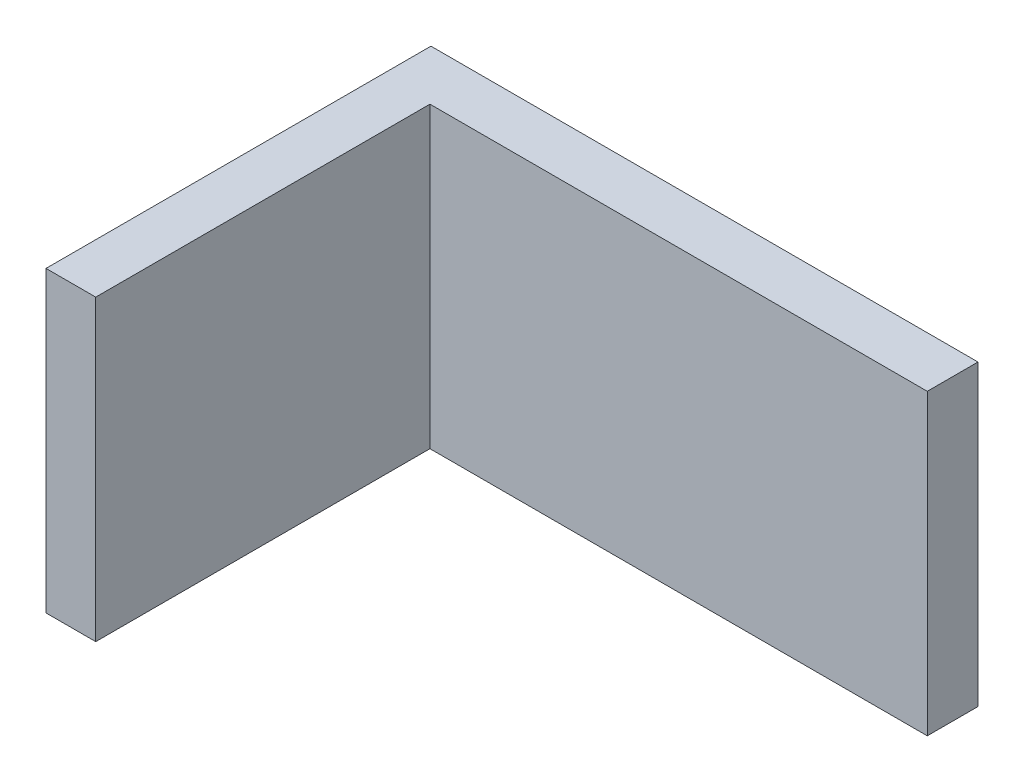
ISO-10303-21;
HEADER;
FILE_DESCRIPTION(('STEP AP214'),'2;1');
FILE_NAME('part.step','',(''),(''),'','','');
FILE_SCHEMA(('AUTOMOTIVE_DESIGN { 1 0 10303 214 1 1 1 1 }'));
ENDSEC;
DATA;
#1=APPLICATION_CONTEXT('core data for automotive mechanical design processes');
#2=APPLICATION_PROTOCOL_DEFINITION('international standard','automotive_design',2000,#1);
#3=PRODUCT_CONTEXT('',#1,'mechanical');
#4=PRODUCT('Part','Part','',(#3));
#5=PRODUCT_RELATED_PRODUCT_CATEGORY('part','',(#4));
#6=PRODUCT_DEFINITION_FORMATION('','',#4);
#7=PRODUCT_DEFINITION_CONTEXT('part definition',#1,'design');
#8=PRODUCT_DEFINITION('design','',#6,#7);
#9=PRODUCT_DEFINITION_SHAPE('','',#8);
#10=(LENGTH_UNIT() NAMED_UNIT(*) SI_UNIT(.MILLI.,.METRE.));
#11=(NAMED_UNIT(*) PLANE_ANGLE_UNIT() SI_UNIT($,.RADIAN.));
#12=(NAMED_UNIT(*) SI_UNIT($,.STERADIAN.) SOLID_ANGLE_UNIT());
#13=UNCERTAINTY_MEASURE_WITH_UNIT(LENGTH_MEASURE(1.E-05),#10,'distance_accuracy_value','');
#14=(GEOMETRIC_REPRESENTATION_CONTEXT(3) GLOBAL_UNCERTAINTY_ASSIGNED_CONTEXT((#13)) GLOBAL_UNIT_ASSIGNED_CONTEXT((#10,
#11,#12)) REPRESENTATION_CONTEXT('',''));
#15=CARTESIAN_POINT('',(0.,0.,0.));
#16=DIRECTION('',(0.,0.,1.));
#17=DIRECTION('',(1.,0.,0.));
#18=AXIS2_PLACEMENT_3D('',#15,#16,#17);
#19=CARTESIAN_POINT('',(-4.55,-1.4,0.));
#20=DIRECTION('',(0.,-1.,0.));
#21=DIRECTION('',(0.,0.,1.));
#22=AXIS2_PLACEMENT_3D('',#19,#20,#21);
#23=PLANE('',#22);
#24=DIRECTION('',(-1.,0.,0.));
#25=VECTOR('',#24,1.);
#26=CARTESIAN_POINT('',(-4.,-1.4,0.));
#27=LINE('',#26,#25);
#28=CARTESIAN_POINT('',(-4.,-1.4,0.));
#29=VERTEX_POINT('',#28);
#30=CARTESIAN_POINT('',(-4.55,-1.4,0.));
#31=VERTEX_POINT('',#30);
#32=EDGE_CURVE('E11',#29,#31,#27,.T.);
#33=ORIENTED_EDGE('',*,*,#32,.F.);
#34=DIRECTION('',(0.,0.,-1.));
#35=VECTOR('',#34,1.);
#36=CARTESIAN_POINT('',(-4.,-1.4,0.051));
#37=LINE('',#36,#35);
#38=CARTESIAN_POINT('',(-4.,-1.4,0.051));
#39=VERTEX_POINT('',#38);
#40=EDGE_CURVE('E24',#39,#29,#37,.T.);
#41=ORIENTED_EDGE('',*,*,#40,.F.);
#42=DIRECTION('',(1.,0.,0.));
#43=VECTOR('',#42,1.);
#44=CARTESIAN_POINT('',(-4.5,-1.4,0.051));
#45=LINE('',#44,#43);
#46=CARTESIAN_POINT('',(-4.5,-1.4,0.051));
#47=VERTEX_POINT('',#46);
#48=EDGE_CURVE('E87',#47,#39,#45,.T.);
#49=ORIENTED_EDGE('',*,*,#48,.F.);
#50=DIRECTION('',(0.,0.,-1.));
#51=VECTOR('',#50,1.);
#52=CARTESIAN_POINT('',(-4.5,-1.4,0.387));
#53=LINE('',#52,#51);
#54=CARTESIAN_POINT('',(-4.5,-1.4,0.387));
#55=VERTEX_POINT('',#54);
#56=EDGE_CURVE('E114',#55,#47,#53,.T.);
#57=ORIENTED_EDGE('',*,*,#56,.F.);
#58=DIRECTION('',(1.,0.,0.));
#59=VECTOR('',#58,1.);
#60=CARTESIAN_POINT('',(-4.55,-1.4,0.387));
#61=LINE('',#60,#59);
#62=CARTESIAN_POINT('',(-4.55,-1.4,0.387));
#63=VERTEX_POINT('',#62);
#64=EDGE_CURVE('E111',#63,#55,#61,.T.);
#65=ORIENTED_EDGE('',*,*,#64,.F.);
#66=DIRECTION('',(0.,0.,1.));
#67=VECTOR('',#66,1.);
#68=CARTESIAN_POINT('',(-4.55,-1.4,0.));
#69=LINE('',#68,#67);
#70=EDGE_CURVE('E108',#31,#63,#69,.T.);
#71=ORIENTED_EDGE('',*,*,#70,.F.);
#72=EDGE_LOOP('',(#33,#41,#49,#57,#65,#71));
#73=FACE_BOUND('',#72,.T.);
#74=ADVANCED_FACE('F17',(#73),#23,.T.);
#75=CARTESIAN_POINT('',(-4.,-1.1,0.));
#76=DIRECTION('',(0.,1.,0.));
#77=DIRECTION('',(0.,0.,1.));
#78=AXIS2_PLACEMENT_3D('',#75,#76,#77);
#79=PLANE('',#78);
#80=DIRECTION('',(1.,0.,0.));
#81=VECTOR('',#80,1.);
#82=CARTESIAN_POINT('',(-4.55,-1.1,0.));
#83=LINE('',#82,#81);
#84=CARTESIAN_POINT('',(-4.55,-1.1,0.));
#85=VERTEX_POINT('',#84);
#86=CARTESIAN_POINT('',(-4.,-1.1,0.));
#87=VERTEX_POINT('',#86);
#88=EDGE_CURVE('E106',#85,#87,#83,.T.);
#89=ORIENTED_EDGE('',*,*,#88,.F.);
#90=DIRECTION('',(0.,0.,-1.));
#91=VECTOR('',#90,1.);
#92=CARTESIAN_POINT('',(-4.55,-1.1,0.387));
#93=LINE('',#92,#91);
#94=CARTESIAN_POINT('',(-4.55,-1.1,0.387));
#95=VERTEX_POINT('',#94);
#96=EDGE_CURVE('E103',#95,#85,#93,.T.);
#97=ORIENTED_EDGE('',*,*,#96,.F.);
#98=DIRECTION('',(-1.,0.,0.));
#99=VECTOR('',#98,1.);
#100=CARTESIAN_POINT('',(-4.5,-1.1,0.387));
#101=LINE('',#100,#99);
#102=CARTESIAN_POINT('',(-4.5,-1.1,0.387));
#103=VERTEX_POINT('',#102);
#104=EDGE_CURVE('E100',#103,#95,#101,.T.);
#105=ORIENTED_EDGE('',*,*,#104,.F.);
#106=DIRECTION('',(0.,0.,1.));
#107=VECTOR('',#106,1.);
#108=CARTESIAN_POINT('',(-4.5,-1.1,0.051));
#109=LINE('',#108,#107);
#110=CARTESIAN_POINT('',(-4.5,-1.1,0.051));
#111=VERTEX_POINT('',#110);
#112=EDGE_CURVE('E72',#111,#103,#109,.T.);
#113=ORIENTED_EDGE('',*,*,#112,.F.);
#114=DIRECTION('',(-1.,0.,0.));
#115=VECTOR('',#114,1.);
#116=CARTESIAN_POINT('',(-4.,-1.1,0.051));
#117=LINE('',#116,#115);
#118=CARTESIAN_POINT('',(-4.,-1.1,0.051));
#119=VERTEX_POINT('',#118);
#120=EDGE_CURVE('E66',#119,#111,#117,.T.);
#121=ORIENTED_EDGE('',*,*,#120,.F.);
#122=DIRECTION('',(0.,0.,1.));
#123=VECTOR('',#122,1.);
#124=CARTESIAN_POINT('',(-4.,-1.1,0.));
#125=LINE('',#124,#123);
#126=EDGE_CURVE('E69',#87,#119,#125,.T.);
#127=ORIENTED_EDGE('',*,*,#126,.F.);
#128=EDGE_LOOP('',(#89,#97,#105,#113,#121,#127));
#129=FACE_BOUND('',#128,.T.);
#130=ADVANCED_FACE('F68',(#129),#79,.T.);
#131=CARTESIAN_POINT('',(-4.55,-1.4,0.387));
#132=DIRECTION('',(0.,0.,1.));
#133=DIRECTION('',(0.,1.,0.));
#134=AXIS2_PLACEMENT_3D('',#131,#132,#133);
#135=PLANE('',#134);
#136=ORIENTED_EDGE('',*,*,#64,.T.);
#137=DIRECTION('',(0.,-1.,0.));
#138=VECTOR('',#137,1.);
#139=CARTESIAN_POINT('',(-4.5,-1.1,0.387));
#140=LINE('',#139,#138);
#141=EDGE_CURVE('E83',#103,#55,#140,.T.);
#142=ORIENTED_EDGE('',*,*,#141,.F.);
#143=ORIENTED_EDGE('',*,*,#104,.T.);
#144=DIRECTION('',(0.,1.,0.));
#145=VECTOR('',#144,1.);
#146=CARTESIAN_POINT('',(-4.55,-1.4,0.387));
#147=LINE('',#146,#145);
#148=EDGE_CURVE('E88',#63,#95,#147,.T.);
#149=ORIENTED_EDGE('',*,*,#148,.F.);
#150=EDGE_LOOP('',(#136,#142,#143,#149));
#151=FACE_BOUND('',#150,.T.);
#152=ADVANCED_FACE('F125',(#151),#135,.T.);
#153=CARTESIAN_POINT('',(-4.5,-1.4,0.051));
#154=DIRECTION('',(0.,0.,1.));
#155=DIRECTION('',(0.,1.,0.));
#156=AXIS2_PLACEMENT_3D('',#153,#154,#155);
#157=PLANE('',#156);
#158=ORIENTED_EDGE('',*,*,#48,.T.);
#159=DIRECTION('',(0.,-1.,0.));
#160=VECTOR('',#159,1.);
#161=CARTESIAN_POINT('',(-4.,-1.1,0.051));
#162=LINE('',#161,#160);
#163=EDGE_CURVE('E81',#119,#39,#162,.T.);
#164=ORIENTED_EDGE('',*,*,#163,.F.);
#165=ORIENTED_EDGE('',*,*,#120,.T.);
#166=DIRECTION('',(0.,1.,0.));
#167=VECTOR('',#166,1.);
#168=CARTESIAN_POINT('',(-4.5,-1.4,0.051));
#169=LINE('',#168,#167);
#170=EDGE_CURVE('E89',#47,#111,#169,.T.);
#171=ORIENTED_EDGE('',*,*,#170,.F.);
#172=EDGE_LOOP('',(#158,#164,#165,#171));
#173=FACE_BOUND('',#172,.T.);
#174=ADVANCED_FACE('F86',(#173),#157,.T.);
#175=CARTESIAN_POINT('',(-4.55,-1.1,0.));
#176=DIRECTION('',(-1.,0.,0.));
#177=DIRECTION('',(0.,0.,1.));
#178=AXIS2_PLACEMENT_3D('',#175,#176,#177);
#179=PLANE('',#178);
#180=DIRECTION('',(0.,1.,0.));
#181=VECTOR('',#180,1.);
#182=CARTESIAN_POINT('',(-4.55,-1.4,0.));
#183=LINE('',#182,#181);
#184=EDGE_CURVE('E93',#31,#85,#183,.T.);
#185=ORIENTED_EDGE('',*,*,#184,.F.);
#186=ORIENTED_EDGE('',*,*,#70,.T.);
#187=ORIENTED_EDGE('',*,*,#148,.T.);
#188=ORIENTED_EDGE('',*,*,#96,.T.);
#189=EDGE_LOOP('',(#185,#186,#187,#188));
#190=FACE_BOUND('',#189,.T.);
#191=ADVANCED_FACE('F121',(#190),#179,.T.);
#192=CARTESIAN_POINT('',(-4.,-1.4,0.));
#193=DIRECTION('',(1.,0.,0.));
#194=DIRECTION('',(0.,0.,1.));
#195=AXIS2_PLACEMENT_3D('',#192,#193,#194);
#196=PLANE('',#195);
#197=DIRECTION('',(0.,-1.,0.));
#198=VECTOR('',#197,1.);
#199=CARTESIAN_POINT('',(-4.,-1.1,0.));
#200=LINE('',#199,#198);
#201=EDGE_CURVE('E82',#87,#29,#200,.T.);
#202=ORIENTED_EDGE('',*,*,#201,.F.);
#203=ORIENTED_EDGE('',*,*,#126,.T.);
#204=ORIENTED_EDGE('',*,*,#163,.T.);
#205=ORIENTED_EDGE('',*,*,#40,.T.);
#206=EDGE_LOOP('',(#202,#203,#204,#205));
#207=FACE_BOUND('',#206,.T.);
#208=ADVANCED_FACE('F80',(#207),#196,.T.);
#209=CARTESIAN_POINT('',(-4.5,-1.4,0.051));
#210=DIRECTION('',(1.,0.,0.));
#211=DIRECTION('',(0.,0.,1.));
#212=AXIS2_PLACEMENT_3D('',#209,#210,#211);
#213=PLANE('',#212);
#214=ORIENTED_EDGE('',*,*,#170,.T.);
#215=ORIENTED_EDGE('',*,*,#112,.T.);
#216=ORIENTED_EDGE('',*,*,#141,.T.);
#217=ORIENTED_EDGE('',*,*,#56,.T.);
#218=EDGE_LOOP('',(#214,#215,#216,#217));
#219=FACE_BOUND('',#218,.T.);
#220=ADVANCED_FACE('F127',(#219),#213,.T.);
#221=CARTESIAN_POINT('',(-4.55,-1.1,0.));
#222=DIRECTION('',(0.,0.,-1.));
#223=DIRECTION('',(0.,1.,0.));
#224=AXIS2_PLACEMENT_3D('',#221,#222,#223);
#225=PLANE('',#224);
#226=ORIENTED_EDGE('',*,*,#88,.T.);
#227=ORIENTED_EDGE('',*,*,#201,.T.);
#228=ORIENTED_EDGE('',*,*,#32,.T.);
#229=ORIENTED_EDGE('',*,*,#184,.T.);
#230=EDGE_LOOP('',(#226,#227,#228,#229));
#231=FACE_BOUND('',#230,.T.);
#232=ADVANCED_FACE('F117',(#231),#225,.T.);
#233=CLOSED_SHELL('',(#74,#130,#152,#174,#191,#208,#220,#232));
#234=MANIFOLD_SOLID_BREP('B1',#233);
#235=ADVANCED_BREP_SHAPE_REPRESENTATION('',(#18,#234),#14);
#236=SHAPE_DEFINITION_REPRESENTATION(#9,#235);
ENDSEC;
END-ISO-10303-21;
